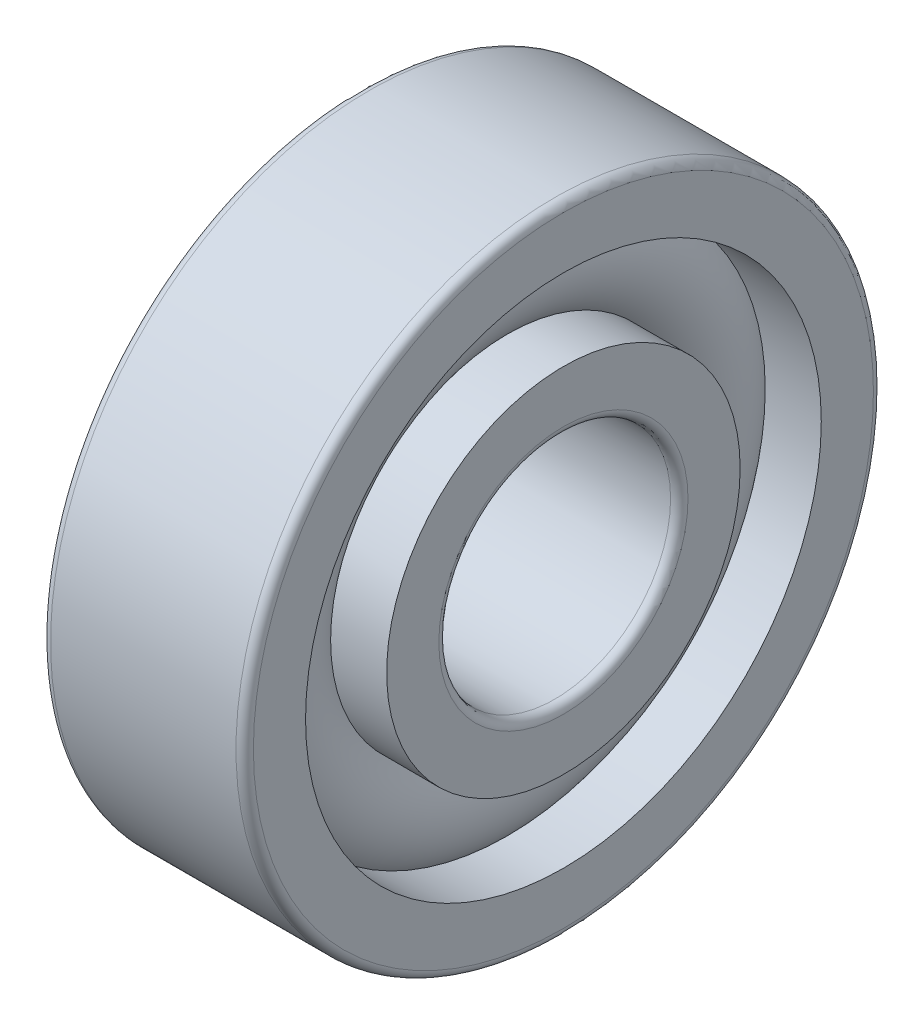
ISO-10303-21;
HEADER;
FILE_DESCRIPTION(('STEP AP214'),'2;1');
FILE_NAME('part.step','',(''),(''),'','','');
FILE_SCHEMA(('AUTOMOTIVE_DESIGN { 1 0 10303 214 1 1 1 1 }'));
ENDSEC;
DATA;
#1=APPLICATION_CONTEXT('core data for automotive mechanical design processes');
#2=APPLICATION_PROTOCOL_DEFINITION('international standard','automotive_design',2000,#1);
#3=PRODUCT_CONTEXT('',#1,'mechanical');
#4=PRODUCT('Part','Part','',(#3));
#5=PRODUCT_RELATED_PRODUCT_CATEGORY('part','',(#4));
#6=PRODUCT_DEFINITION_FORMATION('','',#4);
#7=PRODUCT_DEFINITION_CONTEXT('part definition',#1,'design');
#8=PRODUCT_DEFINITION('design','',#6,#7);
#9=PRODUCT_DEFINITION_SHAPE('','',#8);
#10=(LENGTH_UNIT() NAMED_UNIT(*) SI_UNIT(.MILLI.,.METRE.));
#11=(NAMED_UNIT(*) PLANE_ANGLE_UNIT() SI_UNIT($,.RADIAN.));
#12=(NAMED_UNIT(*) SI_UNIT($,.STERADIAN.) SOLID_ANGLE_UNIT());
#13=UNCERTAINTY_MEASURE_WITH_UNIT(LENGTH_MEASURE(1.E-05),#10,'distance_accuracy_value','');
#14=(GEOMETRIC_REPRESENTATION_CONTEXT(3) GLOBAL_UNCERTAINTY_ASSIGNED_CONTEXT((#13)) GLOBAL_UNIT_ASSIGNED_CONTEXT((#10,
#11,#12)) REPRESENTATION_CONTEXT('',''));
#15=CARTESIAN_POINT('',(0.,0.,0.));
#16=DIRECTION('',(0.,0.,1.));
#17=DIRECTION('',(1.,0.,0.));
#18=AXIS2_PLACEMENT_3D('',#15,#16,#17);
#19=CARTESIAN_POINT('',(0.,0.,0.));
#20=DIRECTION('',(-1.,0.,0.));
#21=DIRECTION('',(0.,0.,1.));
#22=AXIS2_PLACEMENT_3D('',#19,#20,#21);
#23=TOROIDAL_SURFACE('',#22,7.5,2.1);
#24=CARTESIAN_POINT('',(1.56524758424985,0.,0.));
#25=DIRECTION('',(-1.,0.,0.));
#26=DIRECTION('',(0.,0.,1.));
#27=AXIS2_PLACEMENT_3D('',#24,#25,#26);
#28=CIRCLE('',#27,8.90000000000001);
#29=CARTESIAN_POINT('',(1.56524758424985,0.,8.90000000000001));
#30=VERTEX_POINT('',#29);
#31=EDGE_CURVE('E32',#30,#30,#28,.F.);
#32=ORIENTED_EDGE('',*,*,#31,.T.);
#33=EDGE_LOOP('',(#32));
#34=FACE_BOUND('',#33,.T.);
#35=CARTESIAN_POINT('',(1.56524758424985,0.,0.));
#36=DIRECTION('',(-1.,0.,0.));
#37=DIRECTION('',(0.,0.,1.));
#38=AXIS2_PLACEMENT_3D('',#35,#36,#37);
#39=CIRCLE('',#38,6.1);
#40=CARTESIAN_POINT('',(1.56524758424985,0.,6.1));
#41=VERTEX_POINT('',#40);
#42=EDGE_CURVE('E10',#41,#41,#39,.T.);
#43=ORIENTED_EDGE('',*,*,#42,.T.);
#44=EDGE_LOOP('',(#43));
#45=FACE_BOUND('',#44,.T.);
#46=ADVANCED_FACE('F28',(#34,#45),#23,.T.);
#47=CARTESIAN_POINT('',(-20.6375,0.,0.));
#48=DIRECTION('',(1.,0.,0.));
#49=DIRECTION('',(0.,0.,-1.));
#50=AXIS2_PLACEMENT_3D('',#47,#48,#49);
#51=CYLINDRICAL_SURFACE('',#50,6.1);
#52=CARTESIAN_POINT('',(3.5,0.,0.));
#53=DIRECTION('',(1.,0.,0.));
#54=DIRECTION('',(0.,0.,-1.));
#55=AXIS2_PLACEMENT_3D('',#52,#53,#54);
#56=CIRCLE('',#55,6.1);
#57=CARTESIAN_POINT('',(3.5,0.,-6.1));
#58=VERTEX_POINT('',#57);
#59=EDGE_CURVE('E41',#58,#58,#56,.T.);
#60=ORIENTED_EDGE('',*,*,#59,.F.);
#61=EDGE_LOOP('',(#60));
#62=FACE_BOUND('',#61,.T.);
#63=ORIENTED_EDGE('',*,*,#42,.F.);
#64=EDGE_LOOP('',(#63));
#65=FACE_BOUND('',#64,.T.);
#66=ADVANCED_FACE('F80',(#62,#65),#51,.T.);
#67=CARTESIAN_POINT('',(-20.6375,0.,0.));
#68=DIRECTION('',(1.,0.,0.));
#69=DIRECTION('',(0.,0.,-1.));
#70=AXIS2_PLACEMENT_3D('',#67,#68,#69);
#71=CYLINDRICAL_SURFACE('',#70,6.1);
#72=CARTESIAN_POINT('',(-3.5,0.,0.));
#73=DIRECTION('',(1.,0.,0.));
#74=DIRECTION('',(0.,0.,-1.));
#75=AXIS2_PLACEMENT_3D('',#72,#73,#74);
#76=CIRCLE('',#75,6.1);
#77=CARTESIAN_POINT('',(-3.5,0.,-6.1));
#78=VERTEX_POINT('',#77);
#79=EDGE_CURVE('E50',#78,#78,#76,.T.);
#80=ORIENTED_EDGE('',*,*,#79,.T.);
#81=EDGE_LOOP('',(#80));
#82=FACE_BOUND('',#81,.T.);
#83=CARTESIAN_POINT('',(-1.56524758424985,0.,0.));
#84=DIRECTION('',(1.,0.,0.));
#85=DIRECTION('',(0.,0.,-1.));
#86=AXIS2_PLACEMENT_3D('',#83,#84,#85);
#87=CIRCLE('',#86,6.1);
#88=CARTESIAN_POINT('',(-1.56524758424985,0.,-6.1));
#89=VERTEX_POINT('',#88);
#90=EDGE_CURVE('E36',#89,#89,#87,.T.);
#91=ORIENTED_EDGE('',*,*,#90,.F.);
#92=EDGE_LOOP('',(#91));
#93=FACE_BOUND('',#92,.T.);
#94=ADVANCED_FACE('F83',(#82,#93),#71,.T.);
#95=CARTESIAN_POINT('',(3.5,4.3,0.));
#96=DIRECTION('',(1.,0.,0.));
#97=DIRECTION('',(0.,0.,-1.));
#98=AXIS2_PLACEMENT_3D('',#95,#96,#97);
#99=PLANE('',#98);
#100=ORIENTED_EDGE('',*,*,#59,.T.);
#101=EDGE_LOOP('',(#100));
#102=FACE_BOUND('',#101,.T.);
#103=CARTESIAN_POINT('',(3.5,0.,0.));
#104=DIRECTION('',(1.,0.,0.));
#105=DIRECTION('',(0.,0.,-1.));
#106=AXIS2_PLACEMENT_3D('',#103,#104,#105);
#107=CIRCLE('',#106,4.3);
#108=CARTESIAN_POINT('',(3.5,0.,-4.3));
#109=VERTEX_POINT('',#108);
#110=EDGE_CURVE('E72',#109,#109,#107,.T.);
#111=ORIENTED_EDGE('',*,*,#110,.F.);
#112=EDGE_LOOP('',(#111));
#113=FACE_BOUND('',#112,.T.);
#114=ADVANCED_FACE('F77',(#102,#113),#99,.T.);
#115=CARTESIAN_POINT('',(3.2,0.,0.));
#116=DIRECTION('',(1.,0.,0.));
#117=DIRECTION('',(0.,0.,-1.));
#118=AXIS2_PLACEMENT_3D('',#115,#116,#117);
#119=TOROIDAL_SURFACE('',#118,4.3,0.299999999999999);
#120=ORIENTED_EDGE('',*,*,#110,.T.);
#121=EDGE_LOOP('',(#120));
#122=FACE_BOUND('',#121,.T.);
#123=CARTESIAN_POINT('',(3.2,0.,0.));
#124=DIRECTION('',(1.,0.,0.));
#125=DIRECTION('',(0.,0.,-1.));
#126=AXIS2_PLACEMENT_3D('',#123,#124,#125);
#127=CIRCLE('',#126,4.);
#128=CARTESIAN_POINT('',(3.2,0.,-4.));
#129=VERTEX_POINT('',#128);
#130=EDGE_CURVE('E69',#129,#129,#127,.T.);
#131=ORIENTED_EDGE('',*,*,#130,.F.);
#132=EDGE_LOOP('',(#131));
#133=FACE_BOUND('',#132,.T.);
#134=ADVANCED_FACE('F94',(#122,#133),#119,.T.);
#135=CARTESIAN_POINT('',(-20.6375,0.,0.));
#136=DIRECTION('',(1.,0.,0.));
#137=DIRECTION('',(0.,0.,-1.));
#138=AXIS2_PLACEMENT_3D('',#135,#136,#137);
#139=CYLINDRICAL_SURFACE('',#138,4.);
#140=ORIENTED_EDGE('',*,*,#130,.T.);
#141=EDGE_LOOP('',(#140));
#142=FACE_BOUND('',#141,.T.);
#143=CARTESIAN_POINT('',(-3.2,0.,0.));
#144=DIRECTION('',(1.,0.,0.));
#145=DIRECTION('',(0.,0.,-1.));
#146=AXIS2_PLACEMENT_3D('',#143,#144,#145);
#147=CIRCLE('',#146,4.);
#148=CARTESIAN_POINT('',(-3.2,0.,-4.));
#149=VERTEX_POINT('',#148);
#150=EDGE_CURVE('E66',#149,#149,#147,.T.);
#151=ORIENTED_EDGE('',*,*,#150,.F.);
#152=EDGE_LOOP('',(#151));
#153=FACE_BOUND('',#152,.T.);
#154=ADVANCED_FACE('F97',(#142,#153),#139,.F.);
#155=CARTESIAN_POINT('',(-3.2,0.,0.));
#156=DIRECTION('',(1.,0.,0.));
#157=DIRECTION('',(0.,0.,-1.));
#158=AXIS2_PLACEMENT_3D('',#155,#156,#157);
#159=TOROIDAL_SURFACE('',#158,4.3,0.299999999999999);
#160=ORIENTED_EDGE('',*,*,#150,.T.);
#161=EDGE_LOOP('',(#160));
#162=FACE_BOUND('',#161,.T.);
#163=CARTESIAN_POINT('',(-3.5,0.,0.));
#164=DIRECTION('',(1.,0.,0.));
#165=DIRECTION('',(0.,0.,-1.));
#166=AXIS2_PLACEMENT_3D('',#163,#164,#165);
#167=CIRCLE('',#166,4.3);
#168=CARTESIAN_POINT('',(-3.5,0.,-4.3));
#169=VERTEX_POINT('',#168);
#170=EDGE_CURVE('E63',#169,#169,#167,.T.);
#171=ORIENTED_EDGE('',*,*,#170,.F.);
#172=EDGE_LOOP('',(#171));
#173=FACE_BOUND('',#172,.T.);
#174=ADVANCED_FACE('F101',(#162,#173),#159,.T.);
#175=CARTESIAN_POINT('',(-3.5,6.1,0.));
#176=DIRECTION('',(-1.,0.,0.));
#177=DIRECTION('',(0.,0.,1.));
#178=AXIS2_PLACEMENT_3D('',#175,#176,#177);
#179=PLANE('',#178);
#180=ORIENTED_EDGE('',*,*,#170,.T.);
#181=EDGE_LOOP('',(#180));
#182=FACE_BOUND('',#181,.T.);
#183=ORIENTED_EDGE('',*,*,#79,.F.);
#184=EDGE_LOOP('',(#183));
#185=FACE_BOUND('',#184,.T.);
#186=ADVANCED_FACE('F105',(#182,#185),#179,.T.);
#187=CARTESIAN_POINT('',(-1.56524758424985,0.,0.));
#188=DIRECTION('',(1.,0.,0.));
#189=DIRECTION('',(0.,0.,-1.));
#190=AXIS2_PLACEMENT_3D('',#187,#188,#189);
#191=CIRCLE('',#190,8.90000000000001);
#192=CARTESIAN_POINT('',(-1.56524758424985,0.,-8.90000000000001));
#193=VERTEX_POINT('',#192);
#194=EDGE_CURVE('E44',#193,#193,#191,.F.);
#195=ORIENTED_EDGE('',*,*,#194,.T.);
#196=EDGE_LOOP('',(#195));
#197=FACE_BOUND('',#196,.T.);
#198=ORIENTED_EDGE('',*,*,#90,.T.);
#199=EDGE_LOOP('',(#198));
#200=FACE_BOUND('',#199,.T.);
#201=ADVANCED_FACE('F30',(#197,#200),#23,.T.);
#202=CARTESIAN_POINT('',(-20.6375,0.,0.));
#203=DIRECTION('',(1.,0.,0.));
#204=DIRECTION('',(0.,0.,-1.));
#205=AXIS2_PLACEMENT_3D('',#202,#203,#204);
#206=CYLINDRICAL_SURFACE('',#205,8.90000000000001);
#207=CARTESIAN_POINT('',(3.5,0.,0.));
#208=DIRECTION('',(1.,0.,0.));
#209=DIRECTION('',(0.,0.,-1.));
#210=AXIS2_PLACEMENT_3D('',#207,#208,#209);
#211=CIRCLE('',#210,8.90000000000001);
#212=CARTESIAN_POINT('',(3.5,0.,-8.90000000000001));
#213=VERTEX_POINT('',#212);
#214=EDGE_CURVE('E46',#213,#213,#211,.T.);
#215=ORIENTED_EDGE('',*,*,#214,.T.);
#216=EDGE_LOOP('',(#215));
#217=FACE_BOUND('',#216,.T.);
#218=ORIENTED_EDGE('',*,*,#31,.F.);
#219=EDGE_LOOP('',(#218));
#220=FACE_BOUND('',#219,.T.);
#221=ADVANCED_FACE('F110',(#217,#220),#206,.F.);
#222=CARTESIAN_POINT('',(-20.6375,0.,0.));
#223=DIRECTION('',(1.,0.,0.));
#224=DIRECTION('',(0.,0.,-1.));
#225=AXIS2_PLACEMENT_3D('',#222,#223,#224);
#226=CYLINDRICAL_SURFACE('',#225,8.90000000000001);
#227=CARTESIAN_POINT('',(-3.5,0.,0.));
#228=DIRECTION('',(1.,0.,0.));
#229=DIRECTION('',(0.,0.,-1.));
#230=AXIS2_PLACEMENT_3D('',#227,#228,#229);
#231=CIRCLE('',#230,8.90000000000001);
#232=CARTESIAN_POINT('',(-3.5,0.,-8.90000000000001));
#233=VERTEX_POINT('',#232);
#234=EDGE_CURVE('E141',#233,#233,#231,.T.);
#235=ORIENTED_EDGE('',*,*,#234,.F.);
#236=EDGE_LOOP('',(#235));
#237=FACE_BOUND('',#236,.T.);
#238=ORIENTED_EDGE('',*,*,#194,.F.);
#239=EDGE_LOOP('',(#238));
#240=FACE_BOUND('',#239,.T.);
#241=ADVANCED_FACE('F113',(#237,#240),#226,.F.);
#242=CARTESIAN_POINT('',(3.5,10.7,0.));
#243=DIRECTION('',(1.,0.,0.));
#244=DIRECTION('',(0.,0.,-1.));
#245=AXIS2_PLACEMENT_3D('',#242,#243,#244);
#246=PLANE('',#245);
#247=CARTESIAN_POINT('',(3.5,0.,0.));
#248=DIRECTION('',(1.,0.,0.));
#249=DIRECTION('',(0.,0.,-1.));
#250=AXIS2_PLACEMENT_3D('',#247,#248,#249);
#251=CIRCLE('',#250,10.7);
#252=CARTESIAN_POINT('',(3.5,0.,-10.7));
#253=VERTEX_POINT('',#252);
#254=EDGE_CURVE('E52',#253,#253,#251,.T.);
#255=ORIENTED_EDGE('',*,*,#254,.T.);
#256=EDGE_LOOP('',(#255));
#257=FACE_BOUND('',#256,.T.);
#258=ORIENTED_EDGE('',*,*,#214,.F.);
#259=EDGE_LOOP('',(#258));
#260=FACE_BOUND('',#259,.T.);
#261=ADVANCED_FACE('F114',(#257,#260),#246,.T.);
#262=CARTESIAN_POINT('',(3.2,0.,0.));
#263=DIRECTION('',(1.,0.,0.));
#264=DIRECTION('',(0.,0.,-1.));
#265=AXIS2_PLACEMENT_3D('',#262,#263,#264);
#266=TOROIDAL_SURFACE('',#265,10.7,0.299999999999999);
#267=CARTESIAN_POINT('',(3.2,0.,0.));
#268=DIRECTION('',(1.,0.,0.));
#269=DIRECTION('',(0.,0.,-1.));
#270=AXIS2_PLACEMENT_3D('',#267,#268,#269);
#271=CIRCLE('',#270,11.);
#272=CARTESIAN_POINT('',(3.2,0.,-11.));
#273=VERTEX_POINT('',#272);
#274=EDGE_CURVE('E57',#273,#273,#271,.T.);
#275=ORIENTED_EDGE('',*,*,#274,.T.);
#276=EDGE_LOOP('',(#275));
#277=FACE_BOUND('',#276,.T.);
#278=ORIENTED_EDGE('',*,*,#254,.F.);
#279=EDGE_LOOP('',(#278));
#280=FACE_BOUND('',#279,.T.);
#281=ADVANCED_FACE('F117',(#277,#280),#266,.T.);
#282=CARTESIAN_POINT('',(-20.6375,0.,0.));
#283=DIRECTION('',(1.,0.,0.));
#284=DIRECTION('',(0.,0.,-1.));
#285=AXIS2_PLACEMENT_3D('',#282,#283,#284);
#286=CYLINDRICAL_SURFACE('',#285,11.);
#287=CARTESIAN_POINT('',(-3.2,0.,0.));
#288=DIRECTION('',(1.,0.,0.));
#289=DIRECTION('',(0.,0.,-1.));
#290=AXIS2_PLACEMENT_3D('',#287,#288,#289);
#291=CIRCLE('',#290,11.);
#292=CARTESIAN_POINT('',(-3.2,0.,-11.));
#293=VERTEX_POINT('',#292);
#294=EDGE_CURVE('E145',#293,#293,#291,.T.);
#295=ORIENTED_EDGE('',*,*,#294,.T.);
#296=EDGE_LOOP('',(#295));
#297=FACE_BOUND('',#296,.T.);
#298=ORIENTED_EDGE('',*,*,#274,.F.);
#299=EDGE_LOOP('',(#298));
#300=FACE_BOUND('',#299,.T.);
#301=ADVANCED_FACE('F121',(#297,#300),#286,.T.);
#302=CARTESIAN_POINT('',(-3.2,0.,0.));
#303=DIRECTION('',(1.,0.,0.));
#304=DIRECTION('',(0.,0.,-1.));
#305=AXIS2_PLACEMENT_3D('',#302,#303,#304);
#306=TOROIDAL_SURFACE('',#305,10.7,0.299999999999999);
#307=CARTESIAN_POINT('',(-3.5,0.,0.));
#308=DIRECTION('',(1.,0.,0.));
#309=DIRECTION('',(0.,0.,-1.));
#310=AXIS2_PLACEMENT_3D('',#307,#308,#309);
#311=CIRCLE('',#310,10.7);
#312=CARTESIAN_POINT('',(-3.5,0.,-10.7));
#313=VERTEX_POINT('',#312);
#314=EDGE_CURVE('E142',#313,#313,#311,.T.);
#315=ORIENTED_EDGE('',*,*,#314,.T.);
#316=EDGE_LOOP('',(#315));
#317=FACE_BOUND('',#316,.T.);
#318=ORIENTED_EDGE('',*,*,#294,.F.);
#319=EDGE_LOOP('',(#318));
#320=FACE_BOUND('',#319,.T.);
#321=ADVANCED_FACE('F125',(#317,#320),#306,.T.);
#322=CARTESIAN_POINT('',(-3.5,8.90000000000001,0.));
#323=DIRECTION('',(-1.,0.,0.));
#324=DIRECTION('',(0.,0.,1.));
#325=AXIS2_PLACEMENT_3D('',#322,#323,#324);
#326=PLANE('',#325);
#327=ORIENTED_EDGE('',*,*,#234,.T.);
#328=EDGE_LOOP('',(#327));
#329=FACE_BOUND('',#328,.T.);
#330=ORIENTED_EDGE('',*,*,#314,.F.);
#331=EDGE_LOOP('',(#330));
#332=FACE_BOUND('',#331,.T.);
#333=ADVANCED_FACE('F129',(#329,#332),#326,.T.);
#334=CLOSED_SHELL('',(#46,#66,#94,#114,#134,#154,#174,#186,#201,#221,#241,#261,#281,#301,#321,#333));
#335=MANIFOLD_SOLID_BREP('B2',#334);
#336=ADVANCED_BREP_SHAPE_REPRESENTATION('',(#18,#335),#14);
#337=SHAPE_DEFINITION_REPRESENTATION(#9,#336);
ENDSEC;
END-ISO-10303-21;
